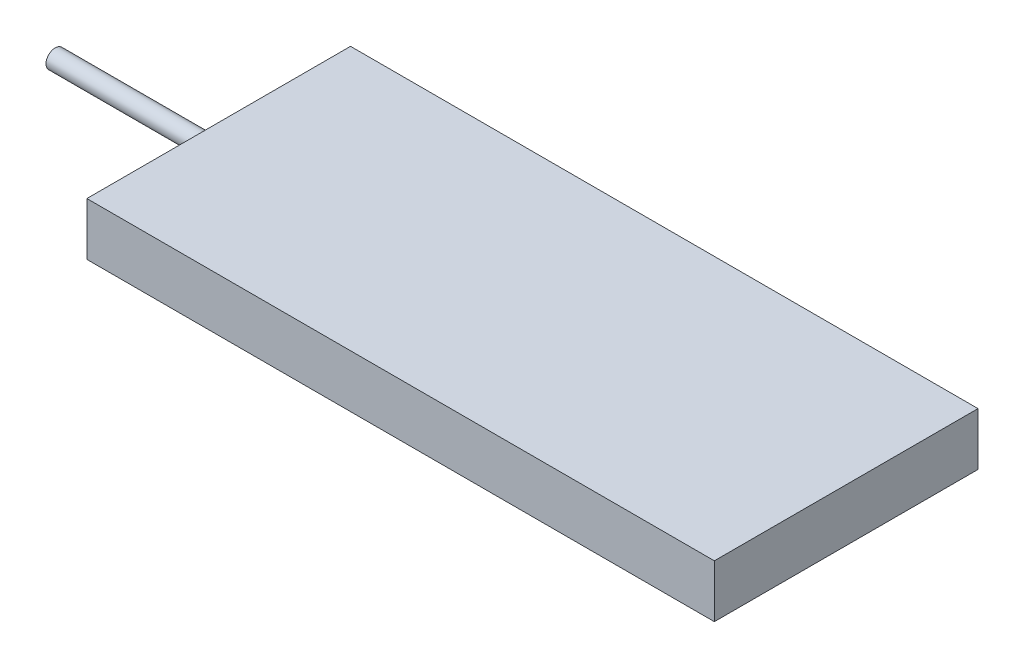
ISO-10303-21;
HEADER;
FILE_DESCRIPTION(('STEP AP214'),'2;1');
FILE_NAME('part.step','',(''),(''),'','','');
FILE_SCHEMA(('AUTOMOTIVE_DESIGN { 1 0 10303 214 1 1 1 1 }'));
ENDSEC;
DATA;
#1=APPLICATION_CONTEXT('core data for automotive mechanical design processes');
#2=APPLICATION_PROTOCOL_DEFINITION('international standard','automotive_design',2000,#1);
#3=PRODUCT_CONTEXT('',#1,'mechanical');
#4=PRODUCT('Part','Part','',(#3));
#5=PRODUCT_RELATED_PRODUCT_CATEGORY('part','',(#4));
#6=PRODUCT_DEFINITION_FORMATION('','',#4);
#7=PRODUCT_DEFINITION_CONTEXT('part definition',#1,'design');
#8=PRODUCT_DEFINITION('design','',#6,#7);
#9=PRODUCT_DEFINITION_SHAPE('','',#8);
#10=(LENGTH_UNIT() NAMED_UNIT(*) SI_UNIT(.MILLI.,.METRE.));
#11=(NAMED_UNIT(*) PLANE_ANGLE_UNIT() SI_UNIT($,.RADIAN.));
#12=(NAMED_UNIT(*) SI_UNIT($,.STERADIAN.) SOLID_ANGLE_UNIT());
#13=UNCERTAINTY_MEASURE_WITH_UNIT(LENGTH_MEASURE(1.E-05),#10,'distance_accuracy_value','');
#14=(GEOMETRIC_REPRESENTATION_CONTEXT(3) GLOBAL_UNCERTAINTY_ASSIGNED_CONTEXT((#13)) GLOBAL_UNIT_ASSIGNED_CONTEXT((#10,
#11,#12)) REPRESENTATION_CONTEXT('',''));
#15=CARTESIAN_POINT('',(0.,0.,0.));
#16=DIRECTION('',(0.,0.,1.));
#17=DIRECTION('',(1.,0.,0.));
#18=AXIS2_PLACEMENT_3D('',#15,#16,#17);
#19=CARTESIAN_POINT('',(0.,20.,0.));
#20=DIRECTION('',(-1.,0.,0.));
#21=DIRECTION('',(0.,0.,1.));
#22=AXIS2_PLACEMENT_3D('',#19,#20,#21);
#23=PLANE('',#22);
#24=CARTESIAN_POINT('',(0.,10.,-50.));
#25=DIRECTION('',(-1.,0.,0.));
#26=DIRECTION('',(0.,0.,1.));
#27=AXIS2_PLACEMENT_3D('',#24,#25,#26);
#28=CIRCLE('',#27,3.5);
#29=CARTESIAN_POINT('',(0.,10.,-46.5));
#30=VERTEX_POINT('',#29);
#31=EDGE_CURVE('E138',#30,#30,#28,.T.);
#32=ORIENTED_EDGE('',*,*,#31,.F.);
#33=EDGE_LOOP('',(#32));
#34=FACE_BOUND('',#33,.T.);
#35=DIRECTION('',(0.,0.,-1.));
#36=VECTOR('',#35,1.);
#37=CARTESIAN_POINT('',(0.,0.,0.));
#38=LINE('',#37,#36);
#39=CARTESIAN_POINT('',(0.,0.,0.));
#40=VERTEX_POINT('',#39);
#41=CARTESIAN_POINT('',(0.,0.,-100.));
#42=VERTEX_POINT('',#41);
#43=EDGE_CURVE('E113',#40,#42,#38,.T.);
#44=ORIENTED_EDGE('',*,*,#43,.F.);
#45=DIRECTION('',(0.,-1.,0.));
#46=VECTOR('',#45,1.);
#47=CARTESIAN_POINT('',(0.,20.,0.));
#48=LINE('',#47,#46);
#49=CARTESIAN_POINT('',(0.,20.,0.));
#50=VERTEX_POINT('',#49);
#51=EDGE_CURVE('E11',#50,#40,#48,.T.);
#52=ORIENTED_EDGE('',*,*,#51,.F.);
#53=DIRECTION('',(0.,0.,-1.));
#54=VECTOR('',#53,1.);
#55=CARTESIAN_POINT('',(0.,20.,0.));
#56=LINE('',#55,#54);
#57=CARTESIAN_POINT('',(0.,20.,-100.));
#58=VERTEX_POINT('',#57);
#59=EDGE_CURVE('E105',#50,#58,#56,.T.);
#60=ORIENTED_EDGE('',*,*,#59,.T.);
#61=DIRECTION('',(0.,-1.,0.));
#62=VECTOR('',#61,1.);
#63=CARTESIAN_POINT('',(0.,20.,-100.));
#64=LINE('',#63,#62);
#65=EDGE_CURVE('E44',#58,#42,#64,.T.);
#66=ORIENTED_EDGE('',*,*,#65,.T.);
#67=EDGE_LOOP('',(#44,#52,#60,#66));
#68=FACE_BOUND('',#67,.T.);
#69=ADVANCED_FACE('F41',(#34,#68),#23,.T.);
#70=CARTESIAN_POINT('',(0.,20.,0.));
#71=DIRECTION('',(0.,0.,-1.));
#72=DIRECTION('',(-1.,0.,0.));
#73=AXIS2_PLACEMENT_3D('',#70,#71,#72);
#74=PLANE('',#73);
#75=DIRECTION('',(1.,0.,0.));
#76=VECTOR('',#75,1.);
#77=CARTESIAN_POINT('',(0.,0.,0.));
#78=LINE('',#77,#76);
#79=CARTESIAN_POINT('',(238.,0.,0.));
#80=VERTEX_POINT('',#79);
#81=EDGE_CURVE('E75',#40,#80,#78,.T.);
#82=ORIENTED_EDGE('',*,*,#81,.T.);
#83=DIRECTION('',(0.,-1.,0.));
#84=VECTOR('',#83,1.);
#85=CARTESIAN_POINT('',(238.,20.,0.));
#86=LINE('',#85,#84);
#87=CARTESIAN_POINT('',(238.,20.,0.));
#88=VERTEX_POINT('',#87);
#89=EDGE_CURVE('E51',#88,#80,#86,.T.);
#90=ORIENTED_EDGE('',*,*,#89,.F.);
#91=DIRECTION('',(1.,0.,0.));
#92=VECTOR('',#91,1.);
#93=CARTESIAN_POINT('',(0.,20.,0.));
#94=LINE('',#93,#92);
#95=EDGE_CURVE('E92',#50,#88,#94,.T.);
#96=ORIENTED_EDGE('',*,*,#95,.F.);
#97=ORIENTED_EDGE('',*,*,#51,.T.);
#98=EDGE_LOOP('',(#82,#90,#96,#97));
#99=FACE_BOUND('',#98,.T.);
#100=ADVANCED_FACE('F130',(#99),#74,.F.);
#101=CARTESIAN_POINT('',(238.,20.,0.));
#102=DIRECTION('',(-1.,0.,0.));
#103=DIRECTION('',(0.,0.,1.));
#104=AXIS2_PLACEMENT_3D('',#101,#102,#103);
#105=PLANE('',#104);
#106=DIRECTION('',(0.,0.,-1.));
#107=VECTOR('',#106,1.);
#108=CARTESIAN_POINT('',(238.,0.,0.));
#109=LINE('',#108,#107);
#110=CARTESIAN_POINT('',(238.,0.,-100.));
#111=VERTEX_POINT('',#110);
#112=EDGE_CURVE('E100',#80,#111,#109,.T.);
#113=ORIENTED_EDGE('',*,*,#112,.T.);
#114=DIRECTION('',(0.,-1.,0.));
#115=VECTOR('',#114,1.);
#116=CARTESIAN_POINT('',(238.,20.,-100.));
#117=LINE('',#116,#115);
#118=CARTESIAN_POINT('',(238.,20.,-100.));
#119=VERTEX_POINT('',#118);
#120=EDGE_CURVE('E97',#119,#111,#117,.T.);
#121=ORIENTED_EDGE('',*,*,#120,.F.);
#122=DIRECTION('',(0.,0.,-1.));
#123=VECTOR('',#122,1.);
#124=CARTESIAN_POINT('',(238.,20.,0.));
#125=LINE('',#124,#123);
#126=EDGE_CURVE('E87',#88,#119,#125,.T.);
#127=ORIENTED_EDGE('',*,*,#126,.F.);
#128=ORIENTED_EDGE('',*,*,#89,.T.);
#129=EDGE_LOOP('',(#113,#121,#127,#128));
#130=FACE_BOUND('',#129,.T.);
#131=ADVANCED_FACE('F98',(#130),#105,.F.);
#132=CARTESIAN_POINT('',(0.,20.,-100.));
#133=DIRECTION('',(0.,0.,-1.));
#134=DIRECTION('',(-1.,0.,0.));
#135=AXIS2_PLACEMENT_3D('',#132,#133,#134);
#136=PLANE('',#135);
#137=DIRECTION('',(1.,0.,0.));
#138=VECTOR('',#137,1.);
#139=CARTESIAN_POINT('',(0.,0.,-100.));
#140=LINE('',#139,#138);
#141=EDGE_CURVE('E117',#42,#111,#140,.T.);
#142=ORIENTED_EDGE('',*,*,#141,.F.);
#143=ORIENTED_EDGE('',*,*,#65,.F.);
#144=DIRECTION('',(1.,0.,0.));
#145=VECTOR('',#144,1.);
#146=CARTESIAN_POINT('',(0.,20.,-100.));
#147=LINE('',#146,#145);
#148=EDGE_CURVE('E91',#58,#119,#147,.T.);
#149=ORIENTED_EDGE('',*,*,#148,.T.);
#150=ORIENTED_EDGE('',*,*,#120,.T.);
#151=EDGE_LOOP('',(#142,#143,#149,#150));
#152=FACE_BOUND('',#151,.T.);
#153=ADVANCED_FACE('F103',(#152),#136,.T.);
#154=CARTESIAN_POINT('',(0.,20.,0.));
#155=DIRECTION('',(0.,-1.,0.));
#156=DIRECTION('',(0.,0.,-1.));
#157=AXIS2_PLACEMENT_3D('',#154,#155,#156);
#158=PLANE('',#157);
#159=ORIENTED_EDGE('',*,*,#59,.F.);
#160=ORIENTED_EDGE('',*,*,#95,.T.);
#161=ORIENTED_EDGE('',*,*,#126,.T.);
#162=ORIENTED_EDGE('',*,*,#148,.F.);
#163=EDGE_LOOP('',(#159,#160,#161,#162));
#164=FACE_BOUND('',#163,.T.);
#165=ADVANCED_FACE('F90',(#164),#158,.F.);
#166=CARTESIAN_POINT('',(0.,0.,0.));
#167=DIRECTION('',(0.,-1.,0.));
#168=DIRECTION('',(0.,0.,-1.));
#169=AXIS2_PLACEMENT_3D('',#166,#167,#168);
#170=PLANE('',#169);
#171=ORIENTED_EDGE('',*,*,#43,.T.);
#172=ORIENTED_EDGE('',*,*,#141,.T.);
#173=ORIENTED_EDGE('',*,*,#112,.F.);
#174=ORIENTED_EDGE('',*,*,#81,.F.);
#175=EDGE_LOOP('',(#171,#172,#173,#174));
#176=FACE_BOUND('',#175,.T.);
#177=ADVANCED_FACE('F127',(#176),#170,.T.);
#178=CARTESIAN_POINT('',(-62.,10.,-50.));
#179=DIRECTION('',(1.,0.,0.));
#180=DIRECTION('',(0.,0.,-1.));
#181=AXIS2_PLACEMENT_3D('',#178,#179,#180);
#182=CYLINDRICAL_SURFACE('',#181,3.5);
#183=CARTESIAN_POINT('',(-62.,10.,-50.));
#184=DIRECTION('',(-1.,0.,0.));
#185=DIRECTION('',(0.,0.,1.));
#186=AXIS2_PLACEMENT_3D('',#183,#184,#185);
#187=CIRCLE('',#186,3.5);
#188=CARTESIAN_POINT('',(-62.,10.,-46.5));
#189=VERTEX_POINT('',#188);
#190=EDGE_CURVE('E118',#189,#189,#187,.T.);
#191=ORIENTED_EDGE('',*,*,#190,.F.);
#192=EDGE_LOOP('',(#191));
#193=FACE_BOUND('',#192,.T.);
#194=ORIENTED_EDGE('',*,*,#31,.T.);
#195=EDGE_LOOP('',(#194));
#196=FACE_BOUND('',#195,.T.);
#197=ADVANCED_FACE('F148',(#193,#196),#182,.T.);
#198=CARTESIAN_POINT('',(-62.,10.,-50.));
#199=DIRECTION('',(-1.,0.,0.));
#200=DIRECTION('',(0.,0.,1.));
#201=AXIS2_PLACEMENT_3D('',#198,#199,#200);
#202=PLANE('',#201);
#203=ORIENTED_EDGE('',*,*,#190,.T.);
#204=EDGE_LOOP('',(#203));
#205=FACE_BOUND('',#204,.T.);
#206=ADVANCED_FACE('F146',(#205),#202,.T.);
#207=CLOSED_SHELL('',(#69,#100,#131,#153,#165,#177,#197,#206));
#208=MANIFOLD_SOLID_BREP('B2',#207);
#209=ADVANCED_BREP_SHAPE_REPRESENTATION('',(#18,#208),#14);
#210=SHAPE_DEFINITION_REPRESENTATION(#9,#209);
ENDSEC;
END-ISO-10303-21;
